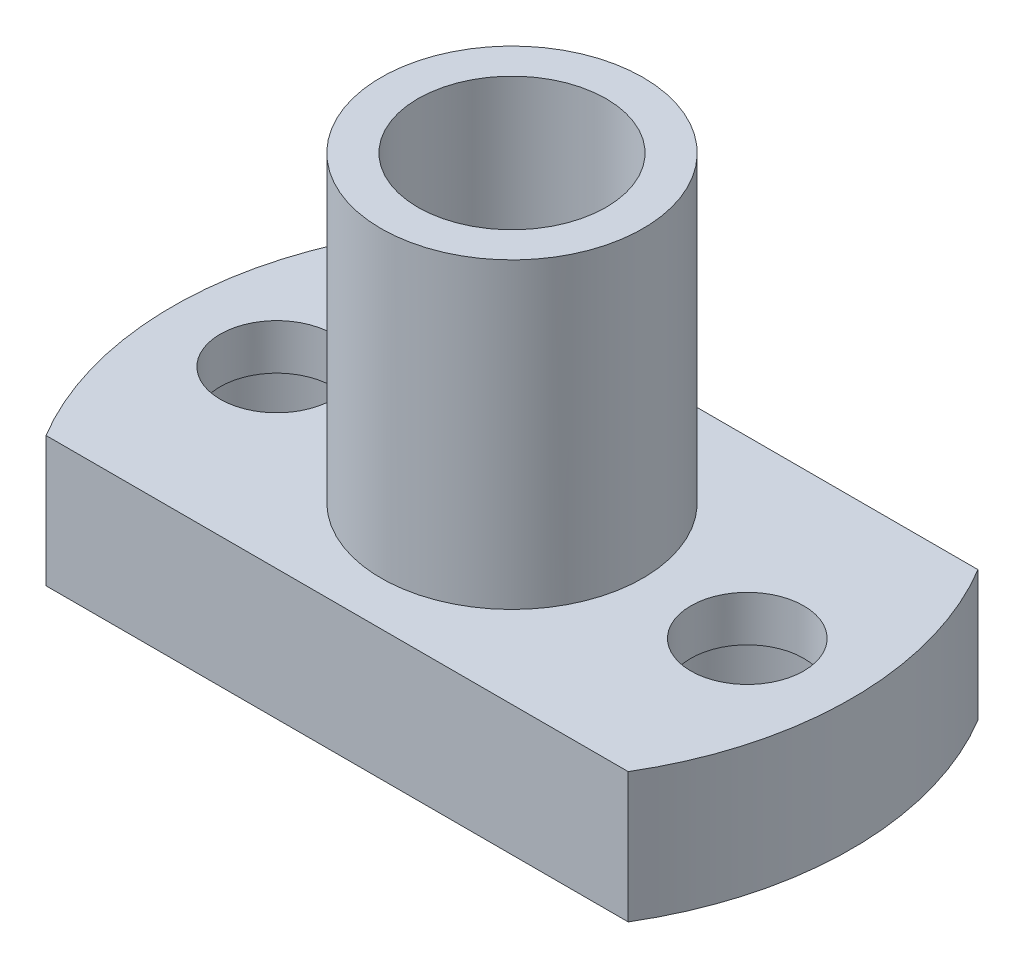
ISO-10303-21;
HEADER;
FILE_DESCRIPTION(('STEP AP214'),'2;1');
FILE_NAME('part.step','',(''),(''),'','','');
FILE_SCHEMA(('AUTOMOTIVE_DESIGN { 1 0 10303 214 1 1 1 1 }'));
ENDSEC;
DATA;
#1=APPLICATION_CONTEXT('core data for automotive mechanical design processes');
#2=APPLICATION_PROTOCOL_DEFINITION('international standard','automotive_design',2000,#1);
#3=PRODUCT_CONTEXT('',#1,'mechanical');
#4=PRODUCT('Part','Part','',(#3));
#5=PRODUCT_RELATED_PRODUCT_CATEGORY('part','',(#4));
#6=PRODUCT_DEFINITION_FORMATION('','',#4);
#7=PRODUCT_DEFINITION_CONTEXT('part definition',#1,'design');
#8=PRODUCT_DEFINITION('design','',#6,#7);
#9=PRODUCT_DEFINITION_SHAPE('','',#8);
#10=(LENGTH_UNIT() NAMED_UNIT(*) SI_UNIT(.MILLI.,.METRE.));
#11=(NAMED_UNIT(*) PLANE_ANGLE_UNIT() SI_UNIT($,.RADIAN.));
#12=(NAMED_UNIT(*) SI_UNIT($,.STERADIAN.) SOLID_ANGLE_UNIT());
#13=UNCERTAINTY_MEASURE_WITH_UNIT(LENGTH_MEASURE(1.E-05),#10,'distance_accuracy_value','');
#14=(GEOMETRIC_REPRESENTATION_CONTEXT(3) GLOBAL_UNCERTAINTY_ASSIGNED_CONTEXT((#13)) GLOBAL_UNIT_ASSIGNED_CONTEXT((#10,
#11,#12)) REPRESENTATION_CONTEXT('',''));
#15=CARTESIAN_POINT('',(0.,0.,0.));
#16=DIRECTION('',(0.,0.,1.));
#17=DIRECTION('',(1.,0.,0.));
#18=AXIS2_PLACEMENT_3D('',#15,#16,#17);
#19=CARTESIAN_POINT('',(-7.5,4.15,0.));
#20=DIRECTION('',(0.,-1.,0.));
#21=DIRECTION('',(0.,0.,-1.));
#22=AXIS2_PLACEMENT_3D('',#19,#20,#21);
#23=CYLINDRICAL_SURFACE('',#22,1.8);
#24=CARTESIAN_POINT('',(-7.5,4.15,0.));
#25=DIRECTION('',(0.,1.,0.));
#26=DIRECTION('',(0.,0.,1.));
#27=AXIS2_PLACEMENT_3D('',#24,#25,#26);
#28=CIRCLE('',#27,1.8);
#29=CARTESIAN_POINT('',(-7.5,4.15,1.8));
#30=VERTEX_POINT('',#29);
#31=EDGE_CURVE('E124',#30,#30,#28,.T.);
#32=ORIENTED_EDGE('',*,*,#31,.T.);
#33=EDGE_LOOP('',(#32));
#34=FACE_BOUND('',#33,.T.);
#35=CARTESIAN_POINT('',(-7.5,2.7,0.));
#36=DIRECTION('',(0.,-1.,0.));
#37=DIRECTION('',(0.,0.,-1.));
#38=AXIS2_PLACEMENT_3D('',#35,#36,#37);
#39=CIRCLE('',#38,1.8);
#40=CARTESIAN_POINT('',(-7.5,2.7,-1.8));
#41=VERTEX_POINT('',#40);
#42=EDGE_CURVE('E49',#41,#41,#39,.T.);
#43=ORIENTED_EDGE('',*,*,#42,.T.);
#44=EDGE_LOOP('',(#43));
#45=FACE_BOUND('',#44,.T.);
#46=ADVANCED_FACE('F45',(#34,#45),#23,.F.);
#47=CARTESIAN_POINT('',(7.5,4.15,0.));
#48=DIRECTION('',(0.,-1.,0.));
#49=DIRECTION('',(0.,0.,-1.));
#50=AXIS2_PLACEMENT_3D('',#47,#48,#49);
#51=CYLINDRICAL_SURFACE('',#50,1.8);
#52=CARTESIAN_POINT('',(7.5,4.15,0.));
#53=DIRECTION('',(0.,1.,0.));
#54=DIRECTION('',(0.,0.,1.));
#55=AXIS2_PLACEMENT_3D('',#52,#53,#54);
#56=CIRCLE('',#55,1.8);
#57=CARTESIAN_POINT('',(7.5,4.15,1.8));
#58=VERTEX_POINT('',#57);
#59=EDGE_CURVE('E174',#58,#58,#56,.T.);
#60=ORIENTED_EDGE('',*,*,#59,.T.);
#61=EDGE_LOOP('',(#60));
#62=FACE_BOUND('',#61,.T.);
#63=CARTESIAN_POINT('',(7.5,2.7,0.));
#64=DIRECTION('',(0.,-1.,0.));
#65=DIRECTION('',(0.,0.,-1.));
#66=AXIS2_PLACEMENT_3D('',#63,#64,#65);
#67=CIRCLE('',#66,1.8);
#68=CARTESIAN_POINT('',(7.5,2.7,-1.8));
#69=VERTEX_POINT('',#68);
#70=EDGE_CURVE('E136',#69,#69,#67,.T.);
#71=ORIENTED_EDGE('',*,*,#70,.T.);
#72=EDGE_LOOP('',(#71));
#73=FACE_BOUND('',#72,.T.);
#74=ADVANCED_FACE('F187',(#62,#73),#51,.F.);
#75=CARTESIAN_POINT('',(0.,4.15,0.));
#76=DIRECTION('',(0.,-1.,0.));
#77=DIRECTION('',(0.,0.,-1.));
#78=AXIS2_PLACEMENT_3D('',#75,#76,#77);
#79=PLANE('',#78);
#80=ORIENTED_EDGE('',*,*,#59,.F.);
#81=EDGE_LOOP('',(#80));
#82=FACE_BOUND('',#81,.T.);
#83=ORIENTED_EDGE('',*,*,#31,.F.);
#84=EDGE_LOOP('',(#83));
#85=FACE_BOUND('',#84,.T.);
#86=CARTESIAN_POINT('',(0.,4.15,0.));
#87=DIRECTION('',(0.,1.,0.));
#88=DIRECTION('',(0.,0.,-1.));
#89=AXIS2_PLACEMENT_3D('',#86,#87,#88);
#90=CIRCLE('',#89,10.825);
#91=CARTESIAN_POINT('',(9.27900856772964,4.15,5.575));
#92=VERTEX_POINT('',#91);
#93=CARTESIAN_POINT('',(9.27900856772964,4.15,-5.575));
#94=VERTEX_POINT('',#93);
#95=EDGE_CURVE('E102',#92,#94,#90,.T.);
#96=ORIENTED_EDGE('',*,*,#95,.T.);
#97=DIRECTION('',(-1.,0.,0.));
#98=VECTOR('',#97,1.);
#99=CARTESIAN_POINT('',(-9.27900856772964,4.15,-5.575));
#100=LINE('',#99,#98);
#101=CARTESIAN_POINT('',(-9.27900856772964,4.15,-5.575));
#102=VERTEX_POINT('',#101);
#103=EDGE_CURVE('E96',#94,#102,#100,.T.);
#104=ORIENTED_EDGE('',*,*,#103,.T.);
#105=CARTESIAN_POINT('',(0.,4.15,0.));
#106=DIRECTION('',(0.,1.,0.));
#107=DIRECTION('',(0.,0.,1.));
#108=AXIS2_PLACEMENT_3D('',#105,#106,#107);
#109=CIRCLE('',#108,10.825);
#110=CARTESIAN_POINT('',(-9.27900856772964,4.15,5.575));
#111=VERTEX_POINT('',#110);
#112=EDGE_CURVE('E100',#102,#111,#109,.T.);
#113=ORIENTED_EDGE('',*,*,#112,.T.);
#114=DIRECTION('',(1.,0.,0.));
#115=VECTOR('',#114,1.);
#116=CARTESIAN_POINT('',(-9.27900856772964,4.15,5.575));
#117=LINE('',#116,#115);
#118=EDGE_CURVE('E65',#111,#92,#117,.T.);
#119=ORIENTED_EDGE('',*,*,#118,.T.);
#120=EDGE_LOOP('',(#96,#104,#113,#119));
#121=FACE_BOUND('',#120,.T.);
#122=CARTESIAN_POINT('',(0.,4.15,0.));
#123=DIRECTION('',(0.,-1.,0.));
#124=DIRECTION('',(0.,0.,-1.));
#125=AXIS2_PLACEMENT_3D('',#122,#123,#124);
#126=CIRCLE('',#125,4.175);
#127=CARTESIAN_POINT('',(0.,4.15,-4.175));
#128=VERTEX_POINT('',#127);
#129=EDGE_CURVE('E12',#128,#128,#126,.F.);
#130=ORIENTED_EDGE('',*,*,#129,.F.);
#131=EDGE_LOOP('',(#130));
#132=FACE_BOUND('',#131,.T.);
#133=ADVANCED_FACE('F97',(#82,#85,#121,#132),#79,.F.);
#134=CARTESIAN_POINT('',(0.,0.,0.));
#135=DIRECTION('',(0.,-1.,0.));
#136=DIRECTION('',(0.,0.,-1.));
#137=AXIS2_PLACEMENT_3D('',#134,#135,#136);
#138=PLANE('',#137);
#139=CARTESIAN_POINT('',(7.5,0.,0.));
#140=DIRECTION('',(0.,-1.,0.));
#141=DIRECTION('',(0.,0.,-1.));
#142=AXIS2_PLACEMENT_3D('',#139,#140,#141);
#143=CIRCLE('',#142,3.);
#144=CARTESIAN_POINT('',(7.5,0.,-3.));
#145=VERTEX_POINT('',#144);
#146=EDGE_CURVE('E147',#145,#145,#143,.T.);
#147=ORIENTED_EDGE('',*,*,#146,.F.);
#148=EDGE_LOOP('',(#147));
#149=FACE_BOUND('',#148,.T.);
#150=CARTESIAN_POINT('',(-7.5,0.,0.));
#151=DIRECTION('',(0.,-1.,0.));
#152=DIRECTION('',(0.,0.,-1.));
#153=AXIS2_PLACEMENT_3D('',#150,#151,#152);
#154=CIRCLE('',#153,3.);
#155=CARTESIAN_POINT('',(-7.5,0.,-3.));
#156=VERTEX_POINT('',#155);
#157=EDGE_CURVE('E153',#156,#156,#154,.T.);
#158=ORIENTED_EDGE('',*,*,#157,.F.);
#159=EDGE_LOOP('',(#158));
#160=FACE_BOUND('',#159,.T.);
#161=CARTESIAN_POINT('',(0.,0.,0.));
#162=DIRECTION('',(0.,1.,0.));
#163=DIRECTION('',(0.,0.,-1.));
#164=AXIS2_PLACEMENT_3D('',#161,#162,#163);
#165=CIRCLE('',#164,10.825);
#166=CARTESIAN_POINT('',(9.27900856772964,0.,5.575));
#167=VERTEX_POINT('',#166);
#168=CARTESIAN_POINT('',(9.27900856772964,0.,-5.575));
#169=VERTEX_POINT('',#168);
#170=EDGE_CURVE('E120',#167,#169,#165,.T.);
#171=ORIENTED_EDGE('',*,*,#170,.F.);
#172=DIRECTION('',(1.,0.,0.));
#173=VECTOR('',#172,1.);
#174=CARTESIAN_POINT('',(-9.27900856772964,0.,5.575));
#175=LINE('',#174,#173);
#176=CARTESIAN_POINT('',(-9.27900856772964,0.,5.575));
#177=VERTEX_POINT('',#176);
#178=EDGE_CURVE('E88',#177,#167,#175,.T.);
#179=ORIENTED_EDGE('',*,*,#178,.F.);
#180=CARTESIAN_POINT('',(0.,0.,0.));
#181=DIRECTION('',(0.,1.,0.));
#182=DIRECTION('',(0.,0.,1.));
#183=AXIS2_PLACEMENT_3D('',#180,#181,#182);
#184=CIRCLE('',#183,10.825);
#185=CARTESIAN_POINT('',(-9.27900856772964,0.,-5.575));
#186=VERTEX_POINT('',#185);
#187=EDGE_CURVE('E82',#186,#177,#184,.T.);
#188=ORIENTED_EDGE('',*,*,#187,.F.);
#189=DIRECTION('',(-1.,0.,0.));
#190=VECTOR('',#189,1.);
#191=CARTESIAN_POINT('',(-9.27900856772964,0.,-5.575));
#192=LINE('',#191,#190);
#193=EDGE_CURVE('E108',#169,#186,#192,.T.);
#194=ORIENTED_EDGE('',*,*,#193,.F.);
#195=EDGE_LOOP('',(#171,#179,#188,#194));
#196=FACE_BOUND('',#195,.T.);
#197=CARTESIAN_POINT('',(0.,0.,0.));
#198=DIRECTION('',(0.,1.,0.));
#199=DIRECTION('',(0.,0.,1.));
#200=AXIS2_PLACEMENT_3D('',#197,#198,#199);
#201=CIRCLE('',#200,3.);
#202=CARTESIAN_POINT('',(0.,0.,3.));
#203=VERTEX_POINT('',#202);
#204=EDGE_CURVE('E170',#203,#203,#201,.T.);
#205=ORIENTED_EDGE('',*,*,#204,.T.);
#206=EDGE_LOOP('',(#205));
#207=FACE_BOUND('',#206,.T.);
#208=ADVANCED_FACE('F186',(#149,#160,#196,#207),#138,.T.);
#209=CARTESIAN_POINT('',(0.,4.15,0.));
#210=DIRECTION('',(0.,-1.,0.));
#211=DIRECTION('',(0.,0.,-1.));
#212=AXIS2_PLACEMENT_3D('',#209,#210,#211);
#213=CYLINDRICAL_SURFACE('',#212,10.825);
#214=ORIENTED_EDGE('',*,*,#170,.T.);
#215=DIRECTION('',(0.,-1.,0.));
#216=VECTOR('',#215,1.);
#217=CARTESIAN_POINT('',(9.27900856772964,4.15,-5.575));
#218=LINE('',#217,#216);
#219=EDGE_CURVE('E56',#94,#169,#218,.T.);
#220=ORIENTED_EDGE('',*,*,#219,.F.);
#221=ORIENTED_EDGE('',*,*,#95,.F.);
#222=DIRECTION('',(0.,-1.,0.));
#223=VECTOR('',#222,1.);
#224=CARTESIAN_POINT('',(9.27900856772964,4.15,5.575));
#225=LINE('',#224,#223);
#226=EDGE_CURVE('E116',#92,#167,#225,.T.);
#227=ORIENTED_EDGE('',*,*,#226,.T.);
#228=EDGE_LOOP('',(#214,#220,#221,#227));
#229=FACE_BOUND('',#228,.T.);
#230=ADVANCED_FACE('F47',(#229),#213,.T.);
#231=CARTESIAN_POINT('',(-9.27900856772964,4.15,-5.575));
#232=DIRECTION('',(0.,0.,1.));
#233=DIRECTION('',(1.,0.,0.));
#234=AXIS2_PLACEMENT_3D('',#231,#232,#233);
#235=PLANE('',#234);
#236=ORIENTED_EDGE('',*,*,#193,.T.);
#237=DIRECTION('',(0.,-1.,0.));
#238=VECTOR('',#237,1.);
#239=CARTESIAN_POINT('',(-9.27900856772964,4.15,-5.575));
#240=LINE('',#239,#238);
#241=EDGE_CURVE('E106',#102,#186,#240,.T.);
#242=ORIENTED_EDGE('',*,*,#241,.F.);
#243=ORIENTED_EDGE('',*,*,#103,.F.);
#244=ORIENTED_EDGE('',*,*,#219,.T.);
#245=EDGE_LOOP('',(#236,#242,#243,#244));
#246=FACE_BOUND('',#245,.T.);
#247=ADVANCED_FACE('F107',(#246),#235,.F.);
#248=CARTESIAN_POINT('',(0.,4.15,0.));
#249=DIRECTION('',(0.,-1.,0.));
#250=DIRECTION('',(0.,0.,-1.));
#251=AXIS2_PLACEMENT_3D('',#248,#249,#250);
#252=CYLINDRICAL_SURFACE('',#251,10.825);
#253=ORIENTED_EDGE('',*,*,#187,.T.);
#254=DIRECTION('',(0.,-1.,0.));
#255=VECTOR('',#254,1.);
#256=CARTESIAN_POINT('',(-9.27900856772964,4.15,5.575));
#257=LINE('',#256,#255);
#258=EDGE_CURVE('E110',#111,#177,#257,.T.);
#259=ORIENTED_EDGE('',*,*,#258,.F.);
#260=ORIENTED_EDGE('',*,*,#112,.F.);
#261=ORIENTED_EDGE('',*,*,#241,.T.);
#262=EDGE_LOOP('',(#253,#259,#260,#261));
#263=FACE_BOUND('',#262,.T.);
#264=ADVANCED_FACE('F112',(#263),#252,.T.);
#265=CARTESIAN_POINT('',(-9.27900856772964,4.15,5.575));
#266=DIRECTION('',(0.,0.,-1.));
#267=DIRECTION('',(-1.,0.,0.));
#268=AXIS2_PLACEMENT_3D('',#265,#266,#267);
#269=PLANE('',#268);
#270=ORIENTED_EDGE('',*,*,#178,.T.);
#271=ORIENTED_EDGE('',*,*,#226,.F.);
#272=ORIENTED_EDGE('',*,*,#118,.F.);
#273=ORIENTED_EDGE('',*,*,#258,.T.);
#274=EDGE_LOOP('',(#270,#271,#272,#273));
#275=FACE_BOUND('',#274,.T.);
#276=ADVANCED_FACE('F210',(#275),#269,.F.);
#277=CARTESIAN_POINT('',(0.,4.15,0.));
#278=DIRECTION('',(0.,-1.,0.));
#279=DIRECTION('',(0.,0.,-1.));
#280=AXIS2_PLACEMENT_3D('',#277,#278,#279);
#281=CYLINDRICAL_SURFACE('',#280,3.);
#282=ORIENTED_EDGE('',*,*,#204,.F.);
#283=EDGE_LOOP('',(#282));
#284=FACE_BOUND('',#283,.T.);
#285=CARTESIAN_POINT('',(0.,13.8,0.));
#286=DIRECTION('',(0.,1.,0.));
#287=DIRECTION('',(0.,0.,1.));
#288=AXIS2_PLACEMENT_3D('',#285,#286,#287);
#289=CIRCLE('',#288,3.);
#290=CARTESIAN_POINT('',(0.,13.8,3.));
#291=VERTEX_POINT('',#290);
#292=EDGE_CURVE('E145',#291,#291,#289,.T.);
#293=ORIENTED_EDGE('',*,*,#292,.T.);
#294=EDGE_LOOP('',(#293));
#295=FACE_BOUND('',#294,.T.);
#296=ADVANCED_FACE('F207',(#284,#295),#281,.F.);
#297=CARTESIAN_POINT('',(0.,13.8,0.));
#298=DIRECTION('',(0.,1.,0.));
#299=DIRECTION('',(0.,0.,1.));
#300=AXIS2_PLACEMENT_3D('',#297,#298,#299);
#301=PLANE('',#300);
#302=CARTESIAN_POINT('',(0.,13.8,0.));
#303=DIRECTION('',(0.,1.,0.));
#304=DIRECTION('',(0.,0.,1.));
#305=AXIS2_PLACEMENT_3D('',#302,#303,#304);
#306=CIRCLE('',#305,4.175);
#307=CARTESIAN_POINT('',(0.,13.8,4.175));
#308=VERTEX_POINT('',#307);
#309=EDGE_CURVE('E166',#308,#308,#306,.T.);
#310=ORIENTED_EDGE('',*,*,#309,.T.);
#311=EDGE_LOOP('',(#310));
#312=FACE_BOUND('',#311,.T.);
#313=ORIENTED_EDGE('',*,*,#292,.F.);
#314=EDGE_LOOP('',(#313));
#315=FACE_BOUND('',#314,.T.);
#316=ADVANCED_FACE('F209',(#312,#315),#301,.T.);
#317=CARTESIAN_POINT('',(0.,13.8,0.));
#318=DIRECTION('',(0.,-1.,0.));
#319=DIRECTION('',(0.,0.,-1.));
#320=AXIS2_PLACEMENT_3D('',#317,#318,#319);
#321=CYLINDRICAL_SURFACE('',#320,4.175);
#322=ORIENTED_EDGE('',*,*,#309,.F.);
#323=EDGE_LOOP('',(#322));
#324=FACE_BOUND('',#323,.T.);
#325=ORIENTED_EDGE('',*,*,#129,.T.);
#326=EDGE_LOOP('',(#325));
#327=FACE_BOUND('',#326,.T.);
#328=ADVANCED_FACE('F212',(#324,#327),#321,.T.);
#329=CARTESIAN_POINT('',(7.5,2.7,0.));
#330=DIRECTION('',(0.,-1.,0.));
#331=DIRECTION('',(0.,0.,-1.));
#332=AXIS2_PLACEMENT_3D('',#329,#330,#331);
#333=CYLINDRICAL_SURFACE('',#332,3.);
#334=CARTESIAN_POINT('',(7.5,2.7,0.));
#335=DIRECTION('',(0.,-1.,0.));
#336=DIRECTION('',(0.,0.,-1.));
#337=AXIS2_PLACEMENT_3D('',#334,#335,#336);
#338=CIRCLE('',#337,3.);
#339=CARTESIAN_POINT('',(7.5,2.7,-3.));
#340=VERTEX_POINT('',#339);
#341=EDGE_CURVE('E139',#340,#340,#338,.T.);
#342=ORIENTED_EDGE('',*,*,#341,.F.);
#343=EDGE_LOOP('',(#342));
#344=FACE_BOUND('',#343,.T.);
#345=ORIENTED_EDGE('',*,*,#146,.T.);
#346=EDGE_LOOP('',(#345));
#347=FACE_BOUND('',#346,.T.);
#348=ADVANCED_FACE('F214',(#344,#347),#333,.F.);
#349=CARTESIAN_POINT('',(7.5,2.7,0.));
#350=DIRECTION('',(0.,-1.,0.));
#351=DIRECTION('',(0.,0.,-1.));
#352=AXIS2_PLACEMENT_3D('',#349,#350,#351);
#353=PLANE('',#352);
#354=ORIENTED_EDGE('',*,*,#70,.F.);
#355=EDGE_LOOP('',(#354));
#356=FACE_BOUND('',#355,.T.);
#357=ORIENTED_EDGE('',*,*,#341,.T.);
#358=EDGE_LOOP('',(#357));
#359=FACE_BOUND('',#358,.T.);
#360=ADVANCED_FACE('F226',(#356,#359),#353,.T.);
#361=CARTESIAN_POINT('',(-7.5,2.7,0.));
#362=DIRECTION('',(0.,-1.,0.));
#363=DIRECTION('',(0.,0.,-1.));
#364=AXIS2_PLACEMENT_3D('',#361,#362,#363);
#365=CYLINDRICAL_SURFACE('',#364,3.);
#366=CARTESIAN_POINT('',(-7.5,2.7,0.));
#367=DIRECTION('',(0.,-1.,0.));
#368=DIRECTION('',(0.,0.,-1.));
#369=AXIS2_PLACEMENT_3D('',#366,#367,#368);
#370=CIRCLE('',#369,3.);
#371=CARTESIAN_POINT('',(-7.5,2.7,-3.));
#372=VERTEX_POINT('',#371);
#373=EDGE_CURVE('E159',#372,#372,#370,.T.);
#374=ORIENTED_EDGE('',*,*,#373,.F.);
#375=EDGE_LOOP('',(#374));
#376=FACE_BOUND('',#375,.T.);
#377=ORIENTED_EDGE('',*,*,#157,.T.);
#378=EDGE_LOOP('',(#377));
#379=FACE_BOUND('',#378,.T.);
#380=ADVANCED_FACE('F222',(#376,#379),#365,.F.);
#381=CARTESIAN_POINT('',(-7.5,2.7,0.));
#382=DIRECTION('',(0.,-1.,0.));
#383=DIRECTION('',(0.,0.,-1.));
#384=AXIS2_PLACEMENT_3D('',#381,#382,#383);
#385=PLANE('',#384);
#386=ORIENTED_EDGE('',*,*,#42,.F.);
#387=EDGE_LOOP('',(#386));
#388=FACE_BOUND('',#387,.T.);
#389=ORIENTED_EDGE('',*,*,#373,.T.);
#390=EDGE_LOOP('',(#389));
#391=FACE_BOUND('',#390,.T.);
#392=ADVANCED_FACE('F219',(#388,#391),#385,.T.);
#393=CLOSED_SHELL('',(#46,#74,#133,#208,#230,#247,#264,#276,#296,#316,#328,#348,#360,#380,#392));
#394=MANIFOLD_SOLID_BREP('B2',#393);
#395=ADVANCED_BREP_SHAPE_REPRESENTATION('',(#18,#394),#14);
#396=SHAPE_DEFINITION_REPRESENTATION(#9,#395);
ENDSEC;
END-ISO-10303-21;
